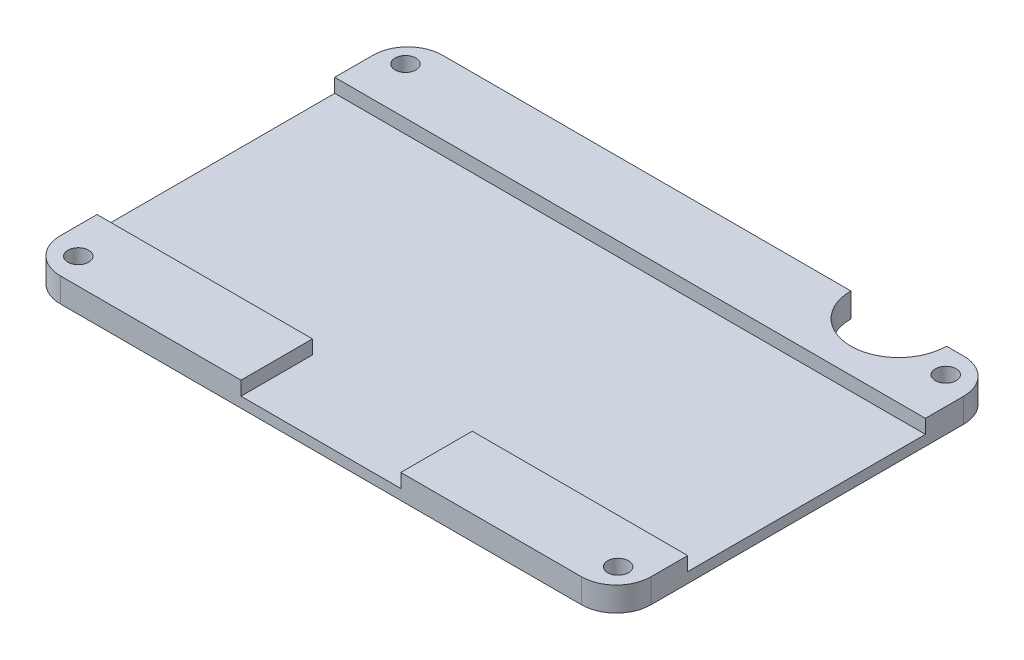
ISO-10303-21;
HEADER;
FILE_DESCRIPTION(('STEP AP214'),'2;1');
FILE_NAME('part.step','',(''),(''),'','','');
FILE_SCHEMA(('AUTOMOTIVE_DESIGN { 1 0 10303 214 1 1 1 1 }'));
ENDSEC;
DATA;
#1=APPLICATION_CONTEXT('core data for automotive mechanical design processes');
#2=APPLICATION_PROTOCOL_DEFINITION('international standard','automotive_design',2000,#1);
#3=PRODUCT_CONTEXT('',#1,'mechanical');
#4=PRODUCT('Part','Part','',(#3));
#5=PRODUCT_RELATED_PRODUCT_CATEGORY('part','',(#4));
#6=PRODUCT_DEFINITION_FORMATION('','',#4);
#7=PRODUCT_DEFINITION_CONTEXT('part definition',#1,'design');
#8=PRODUCT_DEFINITION('design','',#6,#7);
#9=PRODUCT_DEFINITION_SHAPE('','',#8);
#10=(LENGTH_UNIT() NAMED_UNIT(*) SI_UNIT(.MILLI.,.METRE.));
#11=(NAMED_UNIT(*) PLANE_ANGLE_UNIT() SI_UNIT($,.RADIAN.));
#12=(NAMED_UNIT(*) SI_UNIT($,.STERADIAN.) SOLID_ANGLE_UNIT());
#13=UNCERTAINTY_MEASURE_WITH_UNIT(LENGTH_MEASURE(1.E-05),#10,'distance_accuracy_value','');
#14=(GEOMETRIC_REPRESENTATION_CONTEXT(3) GLOBAL_UNCERTAINTY_ASSIGNED_CONTEXT((#13)) GLOBAL_UNIT_ASSIGNED_CONTEXT((#10,
#11,#12)) REPRESENTATION_CONTEXT('',''));
#15=CARTESIAN_POINT('',(0.,0.,0.));
#16=DIRECTION('',(0.,0.,1.));
#17=DIRECTION('',(1.,0.,0.));
#18=AXIS2_PLACEMENT_3D('',#15,#16,#17);
#19=CARTESIAN_POINT('',(54.3775100401606,3.5,42.4347389558233));
#20=DIRECTION('',(0.,1.,0.));
#21=DIRECTION('',(0.,0.,1.));
#22=AXIS2_PLACEMENT_3D('',#19,#20,#21);
#23=PLANE('',#22);
#24=CARTESIAN_POINT('',(-22.1875669871682,3.5,-3.8027186151743));
#25=DIRECTION('',(0.,1.,0.));
#26=DIRECTION('',(0.,0.,1.));
#27=AXIS2_PLACEMENT_3D('',#24,#25,#26);
#28=CIRCLE('',#27,1.5);
#29=CARTESIAN_POINT('',(-22.1875669871682,3.5,-2.3027186151743));
#30=VERTEX_POINT('',#29);
#31=EDGE_CURVE('E402',#30,#30,#28,.T.);
#32=ORIENTED_EDGE('',*,*,#31,.F.);
#33=EDGE_LOOP('',(#32));
#34=FACE_BOUND('',#33,.T.);
#35=CARTESIAN_POINT('',(55.4124330128318,3.5,-3.94786533941863));
#36=DIRECTION('',(0.,1.,0.));
#37=DIRECTION('',(0.,0.,1.));
#38=AXIS2_PLACEMENT_3D('',#35,#36,#37);
#39=CIRCLE('',#38,1.5);
#40=CARTESIAN_POINT('',(55.4124330128318,3.5,-2.44786533941862));
#41=VERTEX_POINT('',#40);
#42=EDGE_CURVE('E394',#41,#41,#39,.T.);
#43=ORIENTED_EDGE('',*,*,#42,.F.);
#44=EDGE_LOOP('',(#43));
#45=FACE_BOUND('',#44,.T.);
#46=DIRECTION('',(-1.,0.,0.));
#47=VECTOR('',#46,1.);
#48=CARTESIAN_POINT('',(-20.6224899598393,3.5,-7.56526104417671));
#49=LINE('',#48,#47);
#50=CARTESIAN_POINT('',(54.3775100401606,3.5,-7.56526104417671));
#51=VERTEX_POINT('',#50);
#52=CARTESIAN_POINT('',(51.9005781196378,3.5,-7.56526104417671));
#53=VERTEX_POINT('',#52);
#54=EDGE_CURVE('E254',#51,#53,#49,.T.);
#55=ORIENTED_EDGE('',*,*,#54,.T.);
#56=CARTESIAN_POINT('',(45.0199922321857,3.5,-7.5652610441767));
#57=DIRECTION('',(0.,-1.,0.));
#58=DIRECTION('',(0.,0.,-1.));
#59=AXIS2_PLACEMENT_3D('',#56,#57,#58);
#60=CIRCLE('',#59,6.8805858874521);
#61=CARTESIAN_POINT('',(38.1394063447336,3.5,-7.56526104417671));
#62=VERTEX_POINT('',#61);
#63=EDGE_CURVE('E177',#53,#62,#60,.T.);
#64=ORIENTED_EDGE('',*,*,#63,.T.);
#65=CARTESIAN_POINT('',(-20.6224899598394,3.5,-7.56526104417671));
#66=VERTEX_POINT('',#65);
#67=EDGE_CURVE('E185',#62,#66,#49,.T.);
#68=ORIENTED_EDGE('',*,*,#67,.T.);
#69=CARTESIAN_POINT('',(-20.6224899598394,3.5,-2.56526104417671));
#70=DIRECTION('',(0.,1.,0.));
#71=DIRECTION('',(0.,0.,-1.));
#72=AXIS2_PLACEMENT_3D('',#69,#70,#71);
#73=CIRCLE('',#72,5.);
#74=CARTESIAN_POINT('',(-25.6224899598394,3.5,-2.56526104417667));
#75=VERTEX_POINT('',#74);
#76=EDGE_CURVE('E257',#66,#75,#73,.T.);
#77=ORIENTED_EDGE('',*,*,#76,.T.);
#78=DIRECTION('',(0.,0.,1.));
#79=VECTOR('',#78,1.);
#80=CARTESIAN_POINT('',(-25.6224899598394,3.5,-2.56526104417667));
#81=LINE('',#80,#79);
#82=CARTESIAN_POINT('',(-25.6224899598394,3.5,2.9472813848257));
#83=VERTEX_POINT('',#82);
#84=EDGE_CURVE('E266',#75,#83,#81,.T.);
#85=ORIENTED_EDGE('',*,*,#84,.T.);
#86=DIRECTION('',(1.,0.,0.));
#87=VECTOR('',#86,1.);
#88=CARTESIAN_POINT('',(0.,3.5,2.9472813848257));
#89=LINE('',#88,#87);
#90=CARTESIAN_POINT('',(59.3775100401606,3.5,2.9472813848257));
#91=VERTEX_POINT('',#90);
#92=EDGE_CURVE('E355',#83,#91,#89,.T.);
#93=ORIENTED_EDGE('',*,*,#92,.T.);
#94=DIRECTION('',(0.,0.,-1.));
#95=VECTOR('',#94,1.);
#96=CARTESIAN_POINT('',(59.3775100401606,3.5,-2.56526104417667));
#97=LINE('',#96,#95);
#98=CARTESIAN_POINT('',(59.3775100401606,3.5,-2.56526104417667));
#99=VERTEX_POINT('',#98);
#100=EDGE_CURVE('E416',#91,#99,#97,.T.);
#101=ORIENTED_EDGE('',*,*,#100,.T.);
#102=CARTESIAN_POINT('',(54.3775100401606,3.5,-2.56526104417671));
#103=DIRECTION('',(0.,1.,0.));
#104=DIRECTION('',(0.,0.,1.));
#105=AXIS2_PLACEMENT_3D('',#102,#103,#104);
#106=CIRCLE('',#105,5.);
#107=EDGE_CURVE('E246',#99,#51,#106,.T.);
#108=ORIENTED_EDGE('',*,*,#107,.T.);
#109=EDGE_LOOP('',(#55,#64,#68,#77,#85,#93,#101,#108));
#110=FACE_BOUND('',#109,.T.);
#111=ADVANCED_FACE('F43',(#34,#45,#110),#23,.T.);
#112=CARTESIAN_POINT('',(-20.6224899598393,3.5,-7.56526104417671));
#113=DIRECTION('',(0.,0.,1.));
#114=DIRECTION('',(1.,0.,0.));
#115=AXIS2_PLACEMENT_3D('',#112,#113,#114);
#116=PLANE('',#115);
#117=DIRECTION('',(0.,1.,0.));
#118=VECTOR('',#117,1.);
#119=CARTESIAN_POINT('',(51.9005781196378,0.,-7.56526104417671));
#120=LINE('',#119,#118);
#121=CARTESIAN_POINT('',(51.9005781196378,0.,-7.56526104417671));
#122=VERTEX_POINT('',#121);
#123=EDGE_CURVE('E59',#122,#53,#120,.T.);
#124=ORIENTED_EDGE('',*,*,#123,.T.);
#125=ORIENTED_EDGE('',*,*,#54,.F.);
#126=DIRECTION('',(0.,-1.,0.));
#127=VECTOR('',#126,1.);
#128=CARTESIAN_POINT('',(54.3775100401606,3.5,-7.56526104417671));
#129=LINE('',#128,#127);
#130=CARTESIAN_POINT('',(54.3775100401606,0.,-7.56526104417671));
#131=VERTEX_POINT('',#130);
#132=EDGE_CURVE('E235',#51,#131,#129,.T.);
#133=ORIENTED_EDGE('',*,*,#132,.T.);
#134=DIRECTION('',(-1.,0.,0.));
#135=VECTOR('',#134,1.);
#136=CARTESIAN_POINT('',(-20.6224899598393,0.,-7.56526104417671));
#137=LINE('',#136,#135);
#138=EDGE_CURVE('E194',#131,#122,#137,.T.);
#139=ORIENTED_EDGE('',*,*,#138,.T.);
#140=EDGE_LOOP('',(#124,#125,#133,#139));
#141=FACE_BOUND('',#140,.T.);
#142=ADVANCED_FACE('F251',(#141),#116,.F.);
#143=DIRECTION('',(0.,1.,0.));
#144=VECTOR('',#143,1.);
#145=CARTESIAN_POINT('',(38.1394063447336,0.,-7.56526104417671));
#146=LINE('',#145,#144);
#147=CARTESIAN_POINT('',(38.1394063447336,0.,-7.56526104417671));
#148=VERTEX_POINT('',#147);
#149=EDGE_CURVE('E170',#148,#62,#146,.T.);
#150=ORIENTED_EDGE('',*,*,#149,.F.);
#151=CARTESIAN_POINT('',(-20.6224899598394,0.,-7.56526104417671));
#152=VERTEX_POINT('',#151);
#153=EDGE_CURVE('E183',#148,#152,#137,.T.);
#154=ORIENTED_EDGE('',*,*,#153,.T.);
#155=DIRECTION('',(0.,-1.,0.));
#156=VECTOR('',#155,1.);
#157=CARTESIAN_POINT('',(-20.6224899598394,3.5,-7.56526104417671));
#158=LINE('',#157,#156);
#159=EDGE_CURVE('E232',#66,#152,#158,.T.);
#160=ORIENTED_EDGE('',*,*,#159,.F.);
#161=ORIENTED_EDGE('',*,*,#67,.F.);
#162=EDGE_LOOP('',(#150,#154,#160,#161));
#163=FACE_BOUND('',#162,.T.);
#164=ADVANCED_FACE('F181',(#163),#116,.F.);
#165=CARTESIAN_POINT('',(54.3775100401606,0.,42.4347389558233));
#166=DIRECTION('',(0.,1.,0.));
#167=DIRECTION('',(0.,0.,1.));
#168=AXIS2_PLACEMENT_3D('',#165,#166,#167);
#169=PLANE('',#168);
#170=CARTESIAN_POINT('',(-21.7754371988893,0.,43.6972813848257));
#171=DIRECTION('',(0.,1.,0.));
#172=DIRECTION('',(0.,0.,1.));
#173=AXIS2_PLACEMENT_3D('',#170,#171,#172);
#174=CIRCLE('',#173,1.5);
#175=CARTESIAN_POINT('',(-21.7754371988893,0.,45.1972813848257));
#176=VERTEX_POINT('',#175);
#177=EDGE_CURVE('E280',#176,#176,#174,.T.);
#178=ORIENTED_EDGE('',*,*,#177,.T.);
#179=EDGE_LOOP('',(#178));
#180=FACE_BOUND('',#179,.T.);
#181=CARTESIAN_POINT('',(55.7665058119681,0.,43.5521346605813));
#182=DIRECTION('',(0.,1.,0.));
#183=DIRECTION('',(0.,0.,1.));
#184=AXIS2_PLACEMENT_3D('',#181,#182,#183);
#185=CIRCLE('',#184,1.5);
#186=CARTESIAN_POINT('',(55.7665058119681,0.,45.0521346605813));
#187=VERTEX_POINT('',#186);
#188=EDGE_CURVE('E390',#187,#187,#185,.T.);
#189=ORIENTED_EDGE('',*,*,#188,.T.);
#190=EDGE_LOOP('',(#189));
#191=FACE_BOUND('',#190,.T.);
#192=CARTESIAN_POINT('',(55.4124330128318,0.,-3.94786533941863));
#193=DIRECTION('',(0.,1.,0.));
#194=DIRECTION('',(0.,0.,1.));
#195=AXIS2_PLACEMENT_3D('',#192,#193,#194);
#196=CIRCLE('',#195,1.5);
#197=CARTESIAN_POINT('',(55.4124330128318,0.,-2.44786533941862));
#198=VERTEX_POINT('',#197);
#199=EDGE_CURVE('E398',#198,#198,#196,.T.);
#200=ORIENTED_EDGE('',*,*,#199,.T.);
#201=EDGE_LOOP('',(#200));
#202=FACE_BOUND('',#201,.T.);
#203=CARTESIAN_POINT('',(-22.1875669871682,0.,-3.8027186151743));
#204=DIRECTION('',(0.,1.,0.));
#205=DIRECTION('',(0.,0.,1.));
#206=AXIS2_PLACEMENT_3D('',#203,#204,#205);
#207=CIRCLE('',#206,1.5);
#208=CARTESIAN_POINT('',(-22.1875669871682,0.,-2.3027186151743));
#209=VERTEX_POINT('',#208);
#210=EDGE_CURVE('E364',#209,#209,#207,.T.);
#211=ORIENTED_EDGE('',*,*,#210,.T.);
#212=EDGE_LOOP('',(#211));
#213=FACE_BOUND('',#212,.T.);
#214=CARTESIAN_POINT('',(45.0199922321857,0.,-7.5652610441767));
#215=DIRECTION('',(0.,-1.,0.));
#216=DIRECTION('',(0.,0.,-1.));
#217=AXIS2_PLACEMENT_3D('',#214,#215,#216);
#218=CIRCLE('',#217,6.8805858874521);
#219=EDGE_CURVE('E167',#122,#148,#218,.T.);
#220=ORIENTED_EDGE('',*,*,#219,.F.);
#221=ORIENTED_EDGE('',*,*,#138,.F.);
#222=CARTESIAN_POINT('',(54.3775100401606,0.,-2.56526104417671));
#223=DIRECTION('',(0.,1.,0.));
#224=DIRECTION('',(0.,0.,1.));
#225=AXIS2_PLACEMENT_3D('',#222,#223,#224);
#226=CIRCLE('',#225,5.);
#227=CARTESIAN_POINT('',(59.3775100401606,0.,-2.56526104417667));
#228=VERTEX_POINT('',#227);
#229=EDGE_CURVE('E195',#228,#131,#226,.T.);
#230=ORIENTED_EDGE('',*,*,#229,.F.);
#231=DIRECTION('',(0.,0.,-1.));
#232=VECTOR('',#231,1.);
#233=CARTESIAN_POINT('',(59.3775100401606,0.,-2.56526104417667));
#234=LINE('',#233,#232);
#235=CARTESIAN_POINT('',(59.3775100401606,0.,42.4347389558233));
#236=VERTEX_POINT('',#235);
#237=EDGE_CURVE('E199',#236,#228,#234,.T.);
#238=ORIENTED_EDGE('',*,*,#237,.F.);
#239=CARTESIAN_POINT('',(54.3775100401606,0.,42.4347389558233));
#240=DIRECTION('',(0.,1.,0.));
#241=DIRECTION('',(0.,0.,1.));
#242=AXIS2_PLACEMENT_3D('',#239,#240,#241);
#243=CIRCLE('',#242,5.);
#244=CARTESIAN_POINT('',(54.3775100401606,0.,47.4347389558233));
#245=VERTEX_POINT('',#244);
#246=EDGE_CURVE('E277',#245,#236,#243,.T.);
#247=ORIENTED_EDGE('',*,*,#246,.F.);
#248=DIRECTION('',(1.,0.,0.));
#249=VECTOR('',#248,1.);
#250=CARTESIAN_POINT('',(-20.6224899598393,0.,47.4347389558233));
#251=LINE('',#250,#249);
#252=CARTESIAN_POINT('',(-20.6224899598393,0.,47.4347389558233));
#253=VERTEX_POINT('',#252);
#254=EDGE_CURVE('E211',#253,#245,#251,.T.);
#255=ORIENTED_EDGE('',*,*,#254,.F.);
#256=CARTESIAN_POINT('',(-20.6224899598394,0.,42.4347389558233));
#257=DIRECTION('',(0.,1.,0.));
#258=DIRECTION('',(0.,0.,-1.));
#259=AXIS2_PLACEMENT_3D('',#256,#257,#258);
#260=CIRCLE('',#259,5.);
#261=CARTESIAN_POINT('',(-25.6224899598394,0.,42.4347389558233));
#262=VERTEX_POINT('',#261);
#263=EDGE_CURVE('E208',#262,#253,#260,.T.);
#264=ORIENTED_EDGE('',*,*,#263,.F.);
#265=DIRECTION('',(0.,0.,1.));
#266=VECTOR('',#265,1.);
#267=CARTESIAN_POINT('',(-25.6224899598394,0.,-2.56526104417667));
#268=LINE('',#267,#266);
#269=CARTESIAN_POINT('',(-25.6224899598394,0.,-2.56526104417667));
#270=VERTEX_POINT('',#269);
#271=EDGE_CURVE('E205',#270,#262,#268,.T.);
#272=ORIENTED_EDGE('',*,*,#271,.F.);
#273=CARTESIAN_POINT('',(-20.6224899598394,0.,-2.56526104417671));
#274=DIRECTION('',(0.,1.,0.));
#275=DIRECTION('',(0.,0.,-1.));
#276=AXIS2_PLACEMENT_3D('',#273,#274,#275);
#277=CIRCLE('',#276,5.);
#278=EDGE_CURVE('E192',#152,#270,#277,.T.);
#279=ORIENTED_EDGE('',*,*,#278,.F.);
#280=ORIENTED_EDGE('',*,*,#153,.F.);
#281=EDGE_LOOP('',(#220,#221,#230,#238,#247,#255,#264,#272,#279,#280));
#282=FACE_BOUND('',#281,.T.);
#283=ADVANCED_FACE('F190',(#180,#191,#202,#213,#282),#169,.F.);
#284=CARTESIAN_POINT('',(59.3775100401606,3.5,-2.56526104417667));
#285=DIRECTION('',(-1.,0.,0.));
#286=DIRECTION('',(0.,0.,1.));
#287=AXIS2_PLACEMENT_3D('',#284,#285,#286);
#288=PLANE('',#287);
#289=DIRECTION('',(0.,1.,0.));
#290=VECTOR('',#289,1.);
#291=CARTESIAN_POINT('',(59.3775100401606,1.5,2.9472813848257));
#292=LINE('',#291,#290);
#293=CARTESIAN_POINT('',(59.3775100401606,1.5,2.9472813848257));
#294=VERTEX_POINT('',#293);
#295=EDGE_CURVE('E374',#294,#91,#292,.T.);
#296=ORIENTED_EDGE('',*,*,#295,.F.);
#297=DIRECTION('',(0.,0.,-1.));
#298=VECTOR('',#297,1.);
#299=CARTESIAN_POINT('',(59.3775100401606,1.5,0.));
#300=LINE('',#299,#298);
#301=CARTESIAN_POINT('',(59.3775100401606,1.5,37.1509688802206));
#302=VERTEX_POINT('',#301);
#303=EDGE_CURVE('E334',#302,#294,#300,.T.);
#304=ORIENTED_EDGE('',*,*,#303,.F.);
#305=DIRECTION('',(0.,1.,0.));
#306=VECTOR('',#305,1.);
#307=CARTESIAN_POINT('',(59.3775100401606,1.5,37.1509688802206));
#308=LINE('',#307,#306);
#309=CARTESIAN_POINT('',(59.3775100401606,3.5,37.1509688802206));
#310=VERTEX_POINT('',#309);
#311=EDGE_CURVE('E377',#302,#310,#308,.T.);
#312=ORIENTED_EDGE('',*,*,#311,.T.);
#313=CARTESIAN_POINT('',(59.3775100401606,3.5,42.4347389558233));
#314=VERTEX_POINT('',#313);
#315=EDGE_CURVE('E287',#314,#310,#97,.T.);
#316=ORIENTED_EDGE('',*,*,#315,.F.);
#317=DIRECTION('',(0.,-1.,0.));
#318=VECTOR('',#317,1.);
#319=CARTESIAN_POINT('',(59.3775100401606,3.5,42.4347389558233));
#320=LINE('',#319,#318);
#321=EDGE_CURVE('E11',#314,#236,#320,.T.);
#322=ORIENTED_EDGE('',*,*,#321,.T.);
#323=ORIENTED_EDGE('',*,*,#237,.T.);
#324=DIRECTION('',(0.,-1.,0.));
#325=VECTOR('',#324,1.);
#326=CARTESIAN_POINT('',(59.3775100401606,3.5,-2.56526104417667));
#327=LINE('',#326,#325);
#328=EDGE_CURVE('E52',#99,#228,#327,.T.);
#329=ORIENTED_EDGE('',*,*,#328,.F.);
#330=ORIENTED_EDGE('',*,*,#100,.F.);
#331=EDGE_LOOP('',(#296,#304,#312,#316,#322,#323,#329,#330));
#332=FACE_BOUND('',#331,.T.);
#333=ADVANCED_FACE('F283',(#332),#288,.F.);
#334=DIRECTION('',(0.,0.,1.));
#335=VECTOR('',#334,1.);
#336=CARTESIAN_POINT('',(5.37751004016062,3.5,0.));
#337=LINE('',#336,#335);
#338=CARTESIAN_POINT('',(5.37751004016063,3.5,37.1509688802206));
#339=VERTEX_POINT('',#338);
#340=CARTESIAN_POINT('',(5.37751004016063,3.5,47.4347389558233));
#341=VERTEX_POINT('',#340);
#342=EDGE_CURVE('E326',#339,#341,#337,.T.);
#343=ORIENTED_EDGE('',*,*,#342,.F.);
#344=DIRECTION('',(1.,0.,0.));
#345=VECTOR('',#344,1.);
#346=CARTESIAN_POINT('',(0.,3.5,37.1509688802206));
#347=LINE('',#346,#345);
#348=CARTESIAN_POINT('',(-25.6224899598394,3.5,37.1509688802206));
#349=VERTEX_POINT('',#348);
#350=EDGE_CURVE('E356',#349,#339,#347,.T.);
#351=ORIENTED_EDGE('',*,*,#350,.F.);
#352=CARTESIAN_POINT('',(-25.6224899598394,3.5,42.4347389558233));
#353=VERTEX_POINT('',#352);
#354=EDGE_CURVE('E261',#349,#353,#81,.T.);
#355=ORIENTED_EDGE('',*,*,#354,.T.);
#356=CARTESIAN_POINT('',(-20.6224899598394,3.5,42.4347389558233));
#357=DIRECTION('',(0.,1.,0.));
#358=DIRECTION('',(0.,0.,-1.));
#359=AXIS2_PLACEMENT_3D('',#356,#357,#358);
#360=CIRCLE('',#359,5.);
#361=CARTESIAN_POINT('',(-20.6224899598393,3.5,47.4347389558233));
#362=VERTEX_POINT('',#361);
#363=EDGE_CURVE('E270',#353,#362,#360,.T.);
#364=ORIENTED_EDGE('',*,*,#363,.T.);
#365=DIRECTION('',(1.,0.,0.));
#366=VECTOR('',#365,1.);
#367=CARTESIAN_POINT('',(-20.6224899598393,3.5,47.4347389558233));
#368=LINE('',#367,#366);
#369=EDGE_CURVE('E220',#362,#341,#368,.T.);
#370=ORIENTED_EDGE('',*,*,#369,.T.);
#371=EDGE_LOOP('',(#343,#351,#355,#364,#370));
#372=FACE_BOUND('',#371,.T.);
#373=CARTESIAN_POINT('',(-21.7754371988893,3.5,43.6972813848257));
#374=DIRECTION('',(0.,1.,0.));
#375=DIRECTION('',(0.,0.,1.));
#376=AXIS2_PLACEMENT_3D('',#373,#374,#375);
#377=CIRCLE('',#376,1.5);
#378=CARTESIAN_POINT('',(-21.7754371988893,3.5,45.1972813848257));
#379=VERTEX_POINT('',#378);
#380=EDGE_CURVE('E389',#379,#379,#377,.T.);
#381=ORIENTED_EDGE('',*,*,#380,.F.);
#382=EDGE_LOOP('',(#381));
#383=FACE_BOUND('',#382,.T.);
#384=ADVANCED_FACE('F439',(#372,#383),#23,.T.);
#385=CARTESIAN_POINT('',(54.3775100401606,3.5,42.4347389558233));
#386=DIRECTION('',(0.,-1.,0.));
#387=DIRECTION('',(0.,0.,-1.));
#388=AXIS2_PLACEMENT_3D('',#385,#386,#387);
#389=CYLINDRICAL_SURFACE('',#388,5.);
#390=ORIENTED_EDGE('',*,*,#246,.T.);
#391=ORIENTED_EDGE('',*,*,#321,.F.);
#392=CARTESIAN_POINT('',(54.3775100401606,3.5,42.4347389558233));
#393=DIRECTION('',(0.,1.,0.));
#394=DIRECTION('',(0.,0.,1.));
#395=AXIS2_PLACEMENT_3D('',#392,#393,#394);
#396=CIRCLE('',#395,5.);
#397=CARTESIAN_POINT('',(54.3775100401606,3.5,47.4347389558233));
#398=VERTEX_POINT('',#397);
#399=EDGE_CURVE('E214',#398,#314,#396,.T.);
#400=ORIENTED_EDGE('',*,*,#399,.F.);
#401=DIRECTION('',(0.,-1.,0.));
#402=VECTOR('',#401,1.);
#403=CARTESIAN_POINT('',(54.3775100401606,3.5,47.4347389558233));
#404=LINE('',#403,#402);
#405=EDGE_CURVE('E215',#398,#245,#404,.T.);
#406=ORIENTED_EDGE('',*,*,#405,.T.);
#407=EDGE_LOOP('',(#390,#391,#400,#406));
#408=FACE_BOUND('',#407,.T.);
#409=ADVANCED_FACE('F45',(#408),#389,.T.);
#410=CARTESIAN_POINT('',(54.3775100401606,3.5,-2.56526104417671));
#411=DIRECTION('',(0.,-1.,0.));
#412=DIRECTION('',(0.,0.,-1.));
#413=AXIS2_PLACEMENT_3D('',#410,#411,#412);
#414=CYLINDRICAL_SURFACE('',#413,5.);
#415=ORIENTED_EDGE('',*,*,#229,.T.);
#416=ORIENTED_EDGE('',*,*,#132,.F.);
#417=ORIENTED_EDGE('',*,*,#107,.F.);
#418=ORIENTED_EDGE('',*,*,#328,.T.);
#419=EDGE_LOOP('',(#415,#416,#417,#418));
#420=FACE_BOUND('',#419,.T.);
#421=ADVANCED_FACE('F244',(#420),#414,.T.);
#422=CARTESIAN_POINT('',(-20.6224899598394,3.5,-2.56526104417671));
#423=DIRECTION('',(0.,-1.,0.));
#424=DIRECTION('',(0.,0.,-1.));
#425=AXIS2_PLACEMENT_3D('',#422,#423,#424);
#426=CYLINDRICAL_SURFACE('',#425,5.);
#427=ORIENTED_EDGE('',*,*,#278,.T.);
#428=DIRECTION('',(0.,-1.,0.));
#429=VECTOR('',#428,1.);
#430=CARTESIAN_POINT('',(-25.6224899598394,3.5,-2.56526104417667));
#431=LINE('',#430,#429);
#432=EDGE_CURVE('E228',#75,#270,#431,.T.);
#433=ORIENTED_EDGE('',*,*,#432,.F.);
#434=ORIENTED_EDGE('',*,*,#76,.F.);
#435=ORIENTED_EDGE('',*,*,#159,.T.);
#436=EDGE_LOOP('',(#427,#433,#434,#435));
#437=FACE_BOUND('',#436,.T.);
#438=ADVANCED_FACE('F314',(#437),#426,.T.);
#439=CARTESIAN_POINT('',(-25.6224899598394,3.5,-2.56526104417667));
#440=DIRECTION('',(1.,0.,0.));
#441=DIRECTION('',(0.,0.,-1.));
#442=AXIS2_PLACEMENT_3D('',#439,#440,#441);
#443=PLANE('',#442);
#444=ORIENTED_EDGE('',*,*,#354,.F.);
#445=DIRECTION('',(0.,1.,0.));
#446=VECTOR('',#445,1.);
#447=CARTESIAN_POINT('',(-25.6224899598394,1.5,37.1509688802206));
#448=LINE('',#447,#446);
#449=CARTESIAN_POINT('',(-25.6224899598394,1.5,37.1509688802206));
#450=VERTEX_POINT('',#449);
#451=EDGE_CURVE('E368',#450,#349,#448,.T.);
#452=ORIENTED_EDGE('',*,*,#451,.F.);
#453=DIRECTION('',(0.,0.,1.));
#454=VECTOR('',#453,1.);
#455=CARTESIAN_POINT('',(-25.6224899598394,1.5,0.));
#456=LINE('',#455,#454);
#457=CARTESIAN_POINT('',(-25.6224899598394,1.5,2.9472813848257));
#458=VERTEX_POINT('',#457);
#459=EDGE_CURVE('E342',#458,#450,#456,.T.);
#460=ORIENTED_EDGE('',*,*,#459,.F.);
#461=DIRECTION('',(0.,1.,0.));
#462=VECTOR('',#461,1.);
#463=CARTESIAN_POINT('',(-25.6224899598394,1.5,2.9472813848257));
#464=LINE('',#463,#462);
#465=EDGE_CURVE('E371',#458,#83,#464,.T.);
#466=ORIENTED_EDGE('',*,*,#465,.T.);
#467=ORIENTED_EDGE('',*,*,#84,.F.);
#468=ORIENTED_EDGE('',*,*,#432,.T.);
#469=ORIENTED_EDGE('',*,*,#271,.T.);
#470=DIRECTION('',(0.,-1.,0.));
#471=VECTOR('',#470,1.);
#472=CARTESIAN_POINT('',(-25.6224899598394,3.5,42.4347389558233));
#473=LINE('',#472,#471);
#474=EDGE_CURVE('E224',#353,#262,#473,.T.);
#475=ORIENTED_EDGE('',*,*,#474,.F.);
#476=EDGE_LOOP('',(#444,#452,#460,#466,#467,#468,#469,#475));
#477=FACE_BOUND('',#476,.T.);
#478=ADVANCED_FACE('F307',(#477),#443,.F.);
#479=CARTESIAN_POINT('',(-20.6224899598394,3.5,42.4347389558233));
#480=DIRECTION('',(0.,-1.,0.));
#481=DIRECTION('',(0.,0.,-1.));
#482=AXIS2_PLACEMENT_3D('',#479,#480,#481);
#483=CYLINDRICAL_SURFACE('',#482,5.);
#484=ORIENTED_EDGE('',*,*,#263,.T.);
#485=DIRECTION('',(0.,-1.,0.));
#486=VECTOR('',#485,1.);
#487=CARTESIAN_POINT('',(-20.6224899598393,3.5,47.4347389558233));
#488=LINE('',#487,#486);
#489=EDGE_CURVE('E219',#362,#253,#488,.T.);
#490=ORIENTED_EDGE('',*,*,#489,.F.);
#491=ORIENTED_EDGE('',*,*,#363,.F.);
#492=ORIENTED_EDGE('',*,*,#474,.T.);
#493=EDGE_LOOP('',(#484,#490,#491,#492));
#494=FACE_BOUND('',#493,.T.);
#495=ADVANCED_FACE('F303',(#494),#483,.T.);
#496=CARTESIAN_POINT('',(-20.6224899598393,3.5,47.4347389558233));
#497=DIRECTION('',(0.,0.,-1.));
#498=DIRECTION('',(-1.,0.,0.));
#499=AXIS2_PLACEMENT_3D('',#496,#497,#498);
#500=PLANE('',#499);
#501=DIRECTION('',(1.,0.,0.));
#502=VECTOR('',#501,1.);
#503=CARTESIAN_POINT('',(0.,1.5,47.4347389558233));
#504=LINE('',#503,#502);
#505=CARTESIAN_POINT('',(5.37751004016063,1.5,47.4347389558233));
#506=VERTEX_POINT('',#505);
#507=CARTESIAN_POINT('',(28.3775100401606,1.5,47.4347389558233));
#508=VERTEX_POINT('',#507);
#509=EDGE_CURVE('E321',#506,#508,#504,.T.);
#510=ORIENTED_EDGE('',*,*,#509,.F.);
#511=DIRECTION('',(0.,1.,0.));
#512=VECTOR('',#511,1.);
#513=CARTESIAN_POINT('',(5.37751004016063,1.5,47.4347389558233));
#514=LINE('',#513,#512);
#515=EDGE_CURVE('E361',#506,#341,#514,.T.);
#516=ORIENTED_EDGE('',*,*,#515,.T.);
#517=ORIENTED_EDGE('',*,*,#369,.F.);
#518=ORIENTED_EDGE('',*,*,#489,.T.);
#519=ORIENTED_EDGE('',*,*,#254,.T.);
#520=ORIENTED_EDGE('',*,*,#405,.F.);
#521=CARTESIAN_POINT('',(28.3775100401606,3.5,47.4347389558233));
#522=VERTEX_POINT('',#521);
#523=EDGE_CURVE('E273',#522,#398,#368,.T.);
#524=ORIENTED_EDGE('',*,*,#523,.F.);
#525=DIRECTION('',(0.,1.,0.));
#526=VECTOR('',#525,1.);
#527=CARTESIAN_POINT('',(28.3775100401606,1.5,47.4347389558233));
#528=LINE('',#527,#526);
#529=EDGE_CURVE('E67',#508,#522,#528,.T.);
#530=ORIENTED_EDGE('',*,*,#529,.F.);
#531=EDGE_LOOP('',(#510,#516,#517,#518,#519,#520,#524,#530));
#532=FACE_BOUND('',#531,.T.);
#533=ADVANCED_FACE('F296',(#532),#500,.F.);
#534=CARTESIAN_POINT('',(28.3775100401606,3.5,37.1509688802206));
#535=VERTEX_POINT('',#534);
#536=EDGE_CURVE('E352',#535,#310,#347,.T.);
#537=ORIENTED_EDGE('',*,*,#536,.F.);
#538=DIRECTION('',(0.,0.,-1.));
#539=VECTOR('',#538,1.);
#540=CARTESIAN_POINT('',(28.3775100401606,3.5,0.));
#541=LINE('',#540,#539);
#542=EDGE_CURVE('E187',#522,#535,#541,.T.);
#543=ORIENTED_EDGE('',*,*,#542,.F.);
#544=ORIENTED_EDGE('',*,*,#523,.T.);
#545=ORIENTED_EDGE('',*,*,#399,.T.);
#546=ORIENTED_EDGE('',*,*,#315,.T.);
#547=EDGE_LOOP('',(#537,#543,#544,#545,#546));
#548=FACE_BOUND('',#547,.T.);
#549=CARTESIAN_POINT('',(55.7665058119681,3.5,43.5521346605813));
#550=DIRECTION('',(0.,1.,0.));
#551=DIRECTION('',(0.,0.,1.));
#552=AXIS2_PLACEMENT_3D('',#549,#550,#551);
#553=CIRCLE('',#552,1.5);
#554=CARTESIAN_POINT('',(55.7665058119681,3.5,45.0521346605813));
#555=VERTEX_POINT('',#554);
#556=EDGE_CURVE('E385',#555,#555,#553,.T.);
#557=ORIENTED_EDGE('',*,*,#556,.F.);
#558=EDGE_LOOP('',(#557));
#559=FACE_BOUND('',#558,.T.);
#560=ADVANCED_FACE('F432',(#548,#559),#23,.T.);
#561=CARTESIAN_POINT('',(-21.7754371988893,0.,43.6972813848257));
#562=DIRECTION('',(0.,1.,0.));
#563=DIRECTION('',(0.,0.,1.));
#564=AXIS2_PLACEMENT_3D('',#561,#562,#563);
#565=CYLINDRICAL_SURFACE('',#564,1.5);
#566=ORIENTED_EDGE('',*,*,#177,.F.);
#567=EDGE_LOOP('',(#566));
#568=FACE_BOUND('',#567,.T.);
#569=ORIENTED_EDGE('',*,*,#380,.T.);
#570=EDGE_LOOP('',(#569));
#571=FACE_BOUND('',#570,.T.);
#572=ADVANCED_FACE('F474',(#568,#571),#565,.F.);
#573=CARTESIAN_POINT('',(55.7665058119681,0.,43.5521346605813));
#574=DIRECTION('',(0.,1.,0.));
#575=DIRECTION('',(0.,0.,1.));
#576=AXIS2_PLACEMENT_3D('',#573,#574,#575);
#577=CYLINDRICAL_SURFACE('',#576,1.5);
#578=ORIENTED_EDGE('',*,*,#188,.F.);
#579=EDGE_LOOP('',(#578));
#580=FACE_BOUND('',#579,.T.);
#581=ORIENTED_EDGE('',*,*,#556,.T.);
#582=EDGE_LOOP('',(#581));
#583=FACE_BOUND('',#582,.T.);
#584=ADVANCED_FACE('F479',(#580,#583),#577,.F.);
#585=CARTESIAN_POINT('',(55.4124330128318,0.,-3.94786533941863));
#586=DIRECTION('',(0.,1.,0.));
#587=DIRECTION('',(0.,0.,1.));
#588=AXIS2_PLACEMENT_3D('',#585,#586,#587);
#589=CYLINDRICAL_SURFACE('',#588,1.5);
#590=ORIENTED_EDGE('',*,*,#199,.F.);
#591=EDGE_LOOP('',(#590));
#592=FACE_BOUND('',#591,.T.);
#593=ORIENTED_EDGE('',*,*,#42,.T.);
#594=EDGE_LOOP('',(#593));
#595=FACE_BOUND('',#594,.T.);
#596=ADVANCED_FACE('F510',(#592,#595),#589,.F.);
#597=CARTESIAN_POINT('',(-22.1875669871682,0.,-3.8027186151743));
#598=DIRECTION('',(0.,1.,0.));
#599=DIRECTION('',(0.,0.,1.));
#600=AXIS2_PLACEMENT_3D('',#597,#598,#599);
#601=CYLINDRICAL_SURFACE('',#600,1.5);
#602=ORIENTED_EDGE('',*,*,#210,.F.);
#603=EDGE_LOOP('',(#602));
#604=FACE_BOUND('',#603,.T.);
#605=ORIENTED_EDGE('',*,*,#31,.T.);
#606=EDGE_LOOP('',(#605));
#607=FACE_BOUND('',#606,.T.);
#608=ADVANCED_FACE('F457',(#604,#607),#601,.F.);
#609=CARTESIAN_POINT('',(5.37751004016062,1.5,0.));
#610=DIRECTION('',(-1.,0.,0.));
#611=DIRECTION('',(0.,0.,1.));
#612=AXIS2_PLACEMENT_3D('',#609,#610,#611);
#613=PLANE('',#612);
#614=ORIENTED_EDGE('',*,*,#342,.T.);
#615=ORIENTED_EDGE('',*,*,#515,.F.);
#616=DIRECTION('',(0.,0.,1.));
#617=VECTOR('',#616,1.);
#618=CARTESIAN_POINT('',(5.37751004016062,1.5,0.));
#619=LINE('',#618,#617);
#620=CARTESIAN_POINT('',(5.37751004016063,1.5,37.1509688802206));
#621=VERTEX_POINT('',#620);
#622=EDGE_CURVE('E346',#621,#506,#619,.T.);
#623=ORIENTED_EDGE('',*,*,#622,.F.);
#624=DIRECTION('',(0.,1.,0.));
#625=VECTOR('',#624,1.);
#626=CARTESIAN_POINT('',(5.37751004016063,1.5,37.1509688802206));
#627=LINE('',#626,#625);
#628=EDGE_CURVE('E365',#621,#339,#627,.T.);
#629=ORIENTED_EDGE('',*,*,#628,.T.);
#630=EDGE_LOOP('',(#614,#615,#623,#629));
#631=FACE_BOUND('',#630,.T.);
#632=ADVANCED_FACE('F448',(#631),#613,.F.);
#633=CARTESIAN_POINT('',(0.,1.5,37.1509688802206));
#634=DIRECTION('',(0.,0.,1.));
#635=DIRECTION('',(1.,0.,0.));
#636=AXIS2_PLACEMENT_3D('',#633,#634,#635);
#637=PLANE('',#636);
#638=ORIENTED_EDGE('',*,*,#350,.T.);
#639=ORIENTED_EDGE('',*,*,#628,.F.);
#640=DIRECTION('',(1.,0.,0.));
#641=VECTOR('',#640,1.);
#642=CARTESIAN_POINT('',(0.,1.5,37.1509688802206));
#643=LINE('',#642,#641);
#644=EDGE_CURVE('E335',#450,#621,#643,.T.);
#645=ORIENTED_EDGE('',*,*,#644,.F.);
#646=ORIENTED_EDGE('',*,*,#451,.T.);
#647=EDGE_LOOP('',(#638,#639,#645,#646));
#648=FACE_BOUND('',#647,.T.);
#649=ADVANCED_FACE('F449',(#648),#637,.F.);
#650=CARTESIAN_POINT('',(0.,1.5,2.9472813848257));
#651=DIRECTION('',(0.,0.,1.));
#652=DIRECTION('',(1.,0.,0.));
#653=AXIS2_PLACEMENT_3D('',#650,#651,#652);
#654=PLANE('',#653);
#655=ORIENTED_EDGE('',*,*,#92,.F.);
#656=ORIENTED_EDGE('',*,*,#465,.F.);
#657=DIRECTION('',(1.,0.,0.));
#658=VECTOR('',#657,1.);
#659=CARTESIAN_POINT('',(0.,1.5,2.9472813848257));
#660=LINE('',#659,#658);
#661=EDGE_CURVE('E339',#458,#294,#660,.T.);
#662=ORIENTED_EDGE('',*,*,#661,.T.);
#663=ORIENTED_EDGE('',*,*,#295,.T.);
#664=EDGE_LOOP('',(#655,#656,#662,#663));
#665=FACE_BOUND('',#664,.T.);
#666=ADVANCED_FACE('F424',(#665),#654,.T.);
#667=ORIENTED_EDGE('',*,*,#536,.T.);
#668=ORIENTED_EDGE('',*,*,#311,.F.);
#669=CARTESIAN_POINT('',(28.3775100401606,1.5,37.1509688802206));
#670=VERTEX_POINT('',#669);
#671=EDGE_CURVE('E330',#670,#302,#643,.T.);
#672=ORIENTED_EDGE('',*,*,#671,.F.);
#673=DIRECTION('',(0.,1.,0.));
#674=VECTOR('',#673,1.);
#675=CARTESIAN_POINT('',(28.3775100401606,1.5,37.1509688802206));
#676=LINE('',#675,#674);
#677=EDGE_CURVE('E380',#670,#535,#676,.T.);
#678=ORIENTED_EDGE('',*,*,#677,.T.);
#679=EDGE_LOOP('',(#667,#668,#672,#678));
#680=FACE_BOUND('',#679,.T.);
#681=ADVANCED_FACE('F431',(#680),#637,.F.);
#682=CARTESIAN_POINT('',(28.3775100401606,1.5,0.));
#683=DIRECTION('',(1.,0.,0.));
#684=DIRECTION('',(0.,0.,-1.));
#685=AXIS2_PLACEMENT_3D('',#682,#683,#684);
#686=PLANE('',#685);
#687=ORIENTED_EDGE('',*,*,#542,.T.);
#688=ORIENTED_EDGE('',*,*,#677,.F.);
#689=DIRECTION('',(0.,0.,-1.));
#690=VECTOR('',#689,1.);
#691=CARTESIAN_POINT('',(28.3775100401606,1.5,0.));
#692=LINE('',#691,#690);
#693=EDGE_CURVE('E325',#508,#670,#692,.T.);
#694=ORIENTED_EDGE('',*,*,#693,.F.);
#695=ORIENTED_EDGE('',*,*,#529,.T.);
#696=EDGE_LOOP('',(#687,#688,#694,#695));
#697=FACE_BOUND('',#696,.T.);
#698=ADVANCED_FACE('F460',(#697),#686,.F.);
#699=CARTESIAN_POINT('',(0.,1.5,0.));
#700=DIRECTION('',(0.,1.,0.));
#701=DIRECTION('',(0.,0.,1.));
#702=AXIS2_PLACEMENT_3D('',#699,#700,#701);
#703=PLANE('',#702);
#704=ORIENTED_EDGE('',*,*,#509,.T.);
#705=ORIENTED_EDGE('',*,*,#693,.T.);
#706=ORIENTED_EDGE('',*,*,#671,.T.);
#707=ORIENTED_EDGE('',*,*,#303,.T.);
#708=ORIENTED_EDGE('',*,*,#661,.F.);
#709=ORIENTED_EDGE('',*,*,#459,.T.);
#710=ORIENTED_EDGE('',*,*,#644,.T.);
#711=ORIENTED_EDGE('',*,*,#622,.T.);
#712=EDGE_LOOP('',(#704,#705,#706,#707,#708,#709,#710,#711));
#713=FACE_BOUND('',#712,.T.);
#714=ADVANCED_FACE('F428',(#713),#703,.T.);
#715=CARTESIAN_POINT('',(45.0199922321857,0.,-7.5652610441767));
#716=DIRECTION('',(0.,1.,0.));
#717=DIRECTION('',(0.,0.,1.));
#718=AXIS2_PLACEMENT_3D('',#715,#716,#717);
#719=CYLINDRICAL_SURFACE('',#718,6.8805858874521);
#720=ORIENTED_EDGE('',*,*,#63,.F.);
#721=ORIENTED_EDGE('',*,*,#123,.F.);
#722=ORIENTED_EDGE('',*,*,#219,.T.);
#723=ORIENTED_EDGE('',*,*,#149,.T.);
#724=EDGE_LOOP('',(#720,#721,#722,#723));
#725=FACE_BOUND('',#724,.T.);
#726=ADVANCED_FACE('F169',(#725),#719,.F.);
#727=CLOSED_SHELL('',(#111,#142,#164,#283,#333,#384,#409,#421,#438,#478,#495,#533,#560,#572,
#584,#596,#608,#632,#649,#666,#681,#698,#714,#726));
#728=MANIFOLD_SOLID_BREP('B2',#727);
#729=ADVANCED_BREP_SHAPE_REPRESENTATION('',(#18,#728),#14);
#730=SHAPE_DEFINITION_REPRESENTATION(#9,#729);
ENDSEC;
END-ISO-10303-21;
